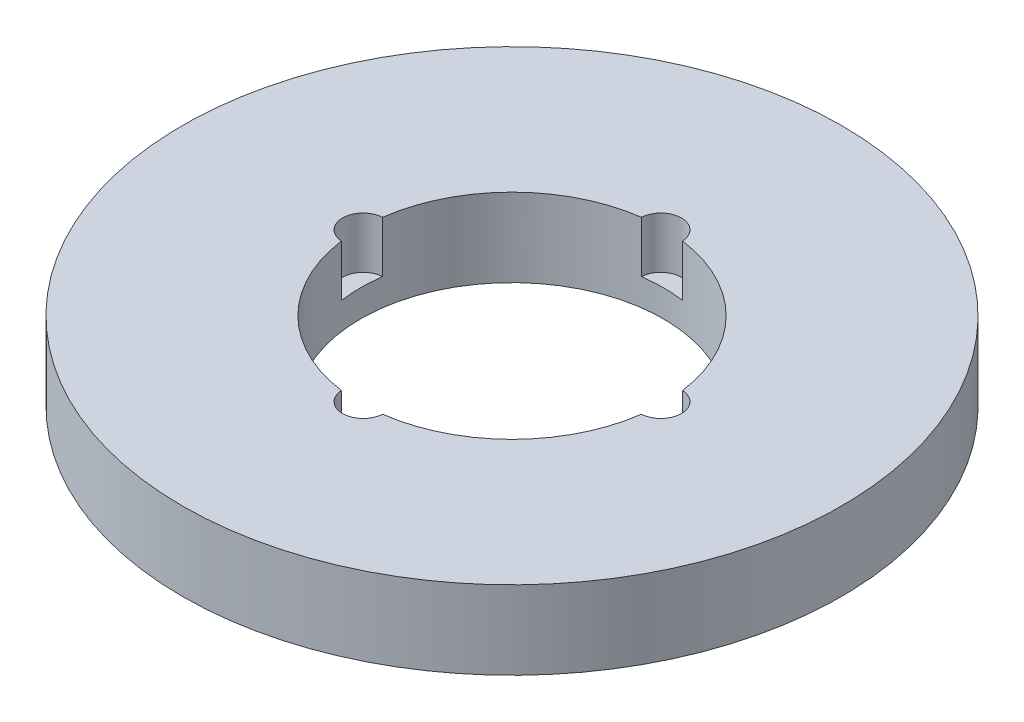
ISO-10303-21;
HEADER;
FILE_DESCRIPTION(('STEP AP214'),'2;1');
FILE_NAME('part.step','',(''),(''),'','','');
FILE_SCHEMA(('AUTOMOTIVE_DESIGN { 1 0 10303 214 1 1 1 1 }'));
ENDSEC;
DATA;
#1=APPLICATION_CONTEXT('core data for automotive mechanical design processes');
#2=APPLICATION_PROTOCOL_DEFINITION('international standard','automotive_design',2000,#1);
#3=PRODUCT_CONTEXT('',#1,'mechanical');
#4=PRODUCT('Part','Part','',(#3));
#5=PRODUCT_RELATED_PRODUCT_CATEGORY('part','',(#4));
#6=PRODUCT_DEFINITION_FORMATION('','',#4);
#7=PRODUCT_DEFINITION_CONTEXT('part definition',#1,'design');
#8=PRODUCT_DEFINITION('design','',#6,#7);
#9=PRODUCT_DEFINITION_SHAPE('','',#8);
#10=(LENGTH_UNIT() NAMED_UNIT(*) SI_UNIT(.MILLI.,.METRE.));
#11=(NAMED_UNIT(*) PLANE_ANGLE_UNIT() SI_UNIT($,.RADIAN.));
#12=(NAMED_UNIT(*) SI_UNIT($,.STERADIAN.) SOLID_ANGLE_UNIT());
#13=UNCERTAINTY_MEASURE_WITH_UNIT(LENGTH_MEASURE(1.E-05),#10,'distance_accuracy_value','');
#14=(GEOMETRIC_REPRESENTATION_CONTEXT(3) GLOBAL_UNCERTAINTY_ASSIGNED_CONTEXT((#13)) GLOBAL_UNIT_ASSIGNED_CONTEXT((#10,
#11,#12)) REPRESENTATION_CONTEXT('',''));
#15=CARTESIAN_POINT('',(0.,0.,0.));
#16=DIRECTION('',(0.,0.,1.));
#17=DIRECTION('',(1.,0.,0.));
#18=AXIS2_PLACEMENT_3D('',#15,#16,#17);
#19=CARTESIAN_POINT('',(0.,22.,0.));
#20=DIRECTION('',(0.,-1.,0.));
#21=DIRECTION('',(0.,0.,-1.));
#22=AXIS2_PLACEMENT_3D('',#19,#20,#21);
#23=CYLINDRICAL_SURFACE('',#22,92.5);
#24=CARTESIAN_POINT('',(0.,22.,0.));
#25=DIRECTION('',(0.,1.,0.));
#26=DIRECTION('',(0.,0.,1.));
#27=AXIS2_PLACEMENT_3D('',#24,#25,#26);
#28=CIRCLE('',#27,92.5);
#29=CARTESIAN_POINT('',(0.,22.,92.5));
#30=VERTEX_POINT('',#29);
#31=EDGE_CURVE('E148',#30,#30,#28,.T.);
#32=ORIENTED_EDGE('',*,*,#31,.F.);
#33=EDGE_LOOP('',(#32));
#34=FACE_BOUND('',#33,.T.);
#35=CARTESIAN_POINT('',(0.,0.,0.));
#36=DIRECTION('',(0.,1.,0.));
#37=DIRECTION('',(0.,0.,1.));
#38=AXIS2_PLACEMENT_3D('',#35,#36,#37);
#39=CIRCLE('',#38,92.5);
#40=CARTESIAN_POINT('',(0.,0.,92.5));
#41=VERTEX_POINT('',#40);
#42=EDGE_CURVE('E139',#41,#41,#39,.T.);
#43=ORIENTED_EDGE('',*,*,#42,.T.);
#44=EDGE_LOOP('',(#43));
#45=FACE_BOUND('',#44,.T.);
#46=ADVANCED_FACE('F39',(#34,#45),#23,.T.);
#47=CARTESIAN_POINT('',(0.,22.,0.));
#48=DIRECTION('',(0.,1.,0.));
#49=DIRECTION('',(0.,0.,1.));
#50=AXIS2_PLACEMENT_3D('',#47,#48,#49);
#51=PLANE('',#50);
#52=CARTESIAN_POINT('',(1.4583632236788E-13,22.,41.7691828237584));
#53=DIRECTION('',(0.,1.,0.));
#54=DIRECTION('',(1.,0.,0.));
#55=AXIS2_PLACEMENT_3D('',#52,#53,#54);
#56=CIRCLE('',#55,5.78742874804722);
#57=CARTESIAN_POINT('',(-5.77765153964873,22.,42.105447897943));
#58=VERTEX_POINT('',#57);
#59=CARTESIAN_POINT('',(5.77765153964902,22.,42.105447897943));
#60=VERTEX_POINT('',#59);
#61=EDGE_CURVE('E175',#58,#60,#56,.T.);
#62=ORIENTED_EDGE('',*,*,#61,.F.);
#63=CARTESIAN_POINT('',(0.,22.,0.));
#64=DIRECTION('',(0.,1.,0.));
#65=DIRECTION('',(0.,0.,1.));
#66=AXIS2_PLACEMENT_3D('',#63,#64,#65);
#67=CIRCLE('',#66,42.5);
#68=CARTESIAN_POINT('',(-42.105447897943,22.,5.77765153964887));
#69=VERTEX_POINT('',#68);
#70=EDGE_CURVE('E134',#69,#58,#67,.T.);
#71=ORIENTED_EDGE('',*,*,#70,.F.);
#72=CARTESIAN_POINT('',(-41.7691828237584,22.,0.));
#73=DIRECTION('',(0.,1.,0.));
#74=DIRECTION('',(0.,0.,1.));
#75=AXIS2_PLACEMENT_3D('',#72,#73,#74);
#76=CIRCLE('',#75,5.78742874804722);
#77=CARTESIAN_POINT('',(-42.105447897943,22.,-5.77765153964887));
#78=VERTEX_POINT('',#77);
#79=EDGE_CURVE('E143',#78,#69,#76,.T.);
#80=ORIENTED_EDGE('',*,*,#79,.F.);
#81=CARTESIAN_POINT('',(-5.77765153964931,22.,-42.105447897943));
#82=VERTEX_POINT('',#81);
#83=EDGE_CURVE('E123',#82,#78,#67,.T.);
#84=ORIENTED_EDGE('',*,*,#83,.F.);
#85=CARTESIAN_POINT('',(-4.37508967103639E-13,22.,-41.7691828237584));
#86=DIRECTION('',(0.,1.,0.));
#87=DIRECTION('',(-1.,0.,0.));
#88=AXIS2_PLACEMENT_3D('',#85,#86,#87);
#89=CIRCLE('',#88,5.78742874804722);
#90=CARTESIAN_POINT('',(5.77765153964843,22.,-42.1054478979431));
#91=VERTEX_POINT('',#90);
#92=EDGE_CURVE('E106',#91,#82,#89,.T.);
#93=ORIENTED_EDGE('',*,*,#92,.F.);
#94=CARTESIAN_POINT('',(42.105447897943,22.,-5.77765153964887));
#95=VERTEX_POINT('',#94);
#96=EDGE_CURVE('E125',#95,#91,#67,.T.);
#97=ORIENTED_EDGE('',*,*,#96,.F.);
#98=CARTESIAN_POINT('',(41.7691828237584,22.,0.));
#99=DIRECTION('',(0.,1.,0.));
#100=DIRECTION('',(0.,0.,-1.));
#101=AXIS2_PLACEMENT_3D('',#98,#99,#100);
#102=CIRCLE('',#101,5.78742874804722);
#103=CARTESIAN_POINT('',(42.105447897943,22.,5.77765153964887));
#104=VERTEX_POINT('',#103);
#105=EDGE_CURVE('E286',#104,#95,#102,.T.);
#106=ORIENTED_EDGE('',*,*,#105,.F.);
#107=EDGE_CURVE('E135',#60,#104,#67,.T.);
#108=ORIENTED_EDGE('',*,*,#107,.F.);
#109=EDGE_LOOP('',(#62,#71,#80,#84,#93,#97,#106,#108));
#110=FACE_BOUND('',#109,.T.);
#111=ORIENTED_EDGE('',*,*,#31,.T.);
#112=EDGE_LOOP('',(#111));
#113=FACE_BOUND('',#112,.T.);
#114=ADVANCED_FACE('F118',(#110,#113),#51,.T.);
#115=CARTESIAN_POINT('',(0.,0.,0.));
#116=DIRECTION('',(0.,1.,0.));
#117=DIRECTION('',(0.,0.,1.));
#118=AXIS2_PLACEMENT_3D('',#115,#116,#117);
#119=PLANE('',#118);
#120=CARTESIAN_POINT('',(0.,0.,0.));
#121=DIRECTION('',(0.,1.,0.));
#122=DIRECTION('',(0.,0.,1.));
#123=AXIS2_PLACEMENT_3D('',#120,#121,#122);
#124=CIRCLE('',#123,42.5);
#125=CARTESIAN_POINT('',(0.,0.,42.5));
#126=VERTEX_POINT('',#125);
#127=EDGE_CURVE('E136',#126,#126,#124,.T.);
#128=ORIENTED_EDGE('',*,*,#127,.T.);
#129=EDGE_LOOP('',(#128));
#130=FACE_BOUND('',#129,.T.);
#131=ORIENTED_EDGE('',*,*,#42,.F.);
#132=EDGE_LOOP('',(#131));
#133=FACE_BOUND('',#132,.T.);
#134=ADVANCED_FACE('F187',(#130,#133),#119,.F.);
#135=CARTESIAN_POINT('',(0.,22.,0.));
#136=DIRECTION('',(0.,-1.,0.));
#137=DIRECTION('',(0.,0.,-1.));
#138=AXIS2_PLACEMENT_3D('',#135,#136,#137);
#139=CYLINDRICAL_SURFACE('',#138,42.5);
#140=DIRECTION('',(0.,1.,0.));
#141=VECTOR('',#140,1.);
#142=CARTESIAN_POINT('',(-5.77765153964873,14.7880694732292,42.105447897943));
#143=LINE('',#142,#141);
#144=CARTESIAN_POINT('',(-5.77765153964873,7.57613894645843,42.105447897943));
#145=VERTEX_POINT('',#144);
#146=EDGE_CURVE('E11',#145,#58,#143,.T.);
#147=ORIENTED_EDGE('',*,*,#146,.F.);
#148=CARTESIAN_POINT('',(0.,7.57613894645843,0.));
#149=DIRECTION('',(0.,1.,0.));
#150=DIRECTION('',(0.,0.,1.));
#151=AXIS2_PLACEMENT_3D('',#148,#149,#150);
#152=CIRCLE('',#151,42.5);
#153=CARTESIAN_POINT('',(5.77765153964902,7.57613894645843,42.105447897943));
#154=VERTEX_POINT('',#153);
#155=EDGE_CURVE('E170',#145,#154,#152,.T.);
#156=ORIENTED_EDGE('',*,*,#155,.T.);
#157=DIRECTION('',(0.,1.,0.));
#158=VECTOR('',#157,1.);
#159=CARTESIAN_POINT('',(5.77765153964902,14.7880694732292,42.105447897943));
#160=LINE('',#159,#158);
#161=EDGE_CURVE('E46',#60,#154,#160,.F.);
#162=ORIENTED_EDGE('',*,*,#161,.F.);
#163=ORIENTED_EDGE('',*,*,#107,.T.);
#164=DIRECTION('',(0.,1.,0.));
#165=VECTOR('',#164,1.);
#166=CARTESIAN_POINT('',(42.105447897943,14.7880694732292,5.77765153964887));
#167=LINE('',#166,#165);
#168=CARTESIAN_POINT('',(42.105447897943,7.57613894645843,5.77765153964887));
#169=VERTEX_POINT('',#168);
#170=EDGE_CURVE('E164',#169,#104,#167,.T.);
#171=ORIENTED_EDGE('',*,*,#170,.F.);
#172=CARTESIAN_POINT('',(0.,7.57613894645843,0.));
#173=DIRECTION('',(0.,1.,0.));
#174=DIRECTION('',(0.,0.,1.));
#175=AXIS2_PLACEMENT_3D('',#172,#173,#174);
#176=CIRCLE('',#175,42.5);
#177=CARTESIAN_POINT('',(42.105447897943,7.57613894645843,-5.77765153964887));
#178=VERTEX_POINT('',#177);
#179=EDGE_CURVE('E115',#169,#178,#176,.T.);
#180=ORIENTED_EDGE('',*,*,#179,.T.);
#181=DIRECTION('',(0.,1.,0.));
#182=VECTOR('',#181,1.);
#183=CARTESIAN_POINT('',(42.105447897943,14.7880694732292,-5.77765153964887));
#184=LINE('',#183,#182);
#185=EDGE_CURVE('E131',#95,#178,#184,.F.);
#186=ORIENTED_EDGE('',*,*,#185,.F.);
#187=ORIENTED_EDGE('',*,*,#96,.T.);
#188=DIRECTION('',(0.,1.,0.));
#189=VECTOR('',#188,1.);
#190=CARTESIAN_POINT('',(5.77765153964843,14.7880694732292,-42.1054478979431));
#191=LINE('',#190,#189);
#192=CARTESIAN_POINT('',(5.77765153964843,7.57613894645843,-42.1054478979431));
#193=VERTEX_POINT('',#192);
#194=EDGE_CURVE('E105',#193,#91,#191,.T.);
#195=ORIENTED_EDGE('',*,*,#194,.F.);
#196=CARTESIAN_POINT('',(0.,7.57613894645843,0.));
#197=DIRECTION('',(0.,1.,0.));
#198=DIRECTION('',(0.,0.,1.));
#199=AXIS2_PLACEMENT_3D('',#196,#197,#198);
#200=CIRCLE('',#199,42.5);
#201=CARTESIAN_POINT('',(-5.77765153964931,7.57613894645843,-42.105447897943));
#202=VERTEX_POINT('',#201);
#203=EDGE_CURVE('E159',#193,#202,#200,.T.);
#204=ORIENTED_EDGE('',*,*,#203,.T.);
#205=DIRECTION('',(0.,1.,0.));
#206=VECTOR('',#205,1.);
#207=CARTESIAN_POINT('',(-5.77765153964931,14.7880694732292,-42.105447897943));
#208=LINE('',#207,#206);
#209=EDGE_CURVE('E114',#82,#202,#208,.F.);
#210=ORIENTED_EDGE('',*,*,#209,.F.);
#211=ORIENTED_EDGE('',*,*,#83,.T.);
#212=DIRECTION('',(0.,1.,0.));
#213=VECTOR('',#212,1.);
#214=CARTESIAN_POINT('',(-42.105447897943,14.7880694732292,-5.77765153964887));
#215=LINE('',#214,#213);
#216=CARTESIAN_POINT('',(-42.105447897943,7.57613894645843,-5.77765153964887));
#217=VERTEX_POINT('',#216);
#218=EDGE_CURVE('E160',#217,#78,#215,.T.);
#219=ORIENTED_EDGE('',*,*,#218,.F.);
#220=CARTESIAN_POINT('',(0.,7.57613894645843,0.));
#221=DIRECTION('',(0.,1.,0.));
#222=DIRECTION('',(0.,0.,1.));
#223=AXIS2_PLACEMENT_3D('',#220,#221,#222);
#224=CIRCLE('',#223,42.5);
#225=CARTESIAN_POINT('',(-42.105447897943,7.57613894645843,5.77765153964887));
#226=VERTEX_POINT('',#225);
#227=EDGE_CURVE('E149',#217,#226,#224,.T.);
#228=ORIENTED_EDGE('',*,*,#227,.T.);
#229=DIRECTION('',(0.,1.,0.));
#230=VECTOR('',#229,1.);
#231=CARTESIAN_POINT('',(-42.105447897943,14.7880694732292,5.77765153964887));
#232=LINE('',#231,#230);
#233=EDGE_CURVE('E152',#69,#226,#232,.F.);
#234=ORIENTED_EDGE('',*,*,#233,.F.);
#235=ORIENTED_EDGE('',*,*,#70,.T.);
#236=EDGE_LOOP('',(#147,#156,#162,#163,#171,#180,#186,#187,#195,#204,#210,#211,#219,#228,#234,#235));
#237=FACE_BOUND('',#236,.T.);
#238=ORIENTED_EDGE('',*,*,#127,.F.);
#239=EDGE_LOOP('',(#238));
#240=FACE_BOUND('',#239,.T.);
#241=ADVANCED_FACE('F126',(#237,#240),#139,.F.);
#242=CARTESIAN_POINT('',(-41.7691828237584,7.57613894645843,0.));
#243=DIRECTION('',(0.,1.,0.));
#244=DIRECTION('',(0.,0.,1.));
#245=AXIS2_PLACEMENT_3D('',#242,#243,#244);
#246=CYLINDRICAL_SURFACE('',#245,5.78742874804722);
#247=ORIENTED_EDGE('',*,*,#218,.T.);
#248=ORIENTED_EDGE('',*,*,#79,.T.);
#249=ORIENTED_EDGE('',*,*,#233,.T.);
#250=CARTESIAN_POINT('',(-41.7691828237584,7.57613894645843,0.));
#251=DIRECTION('',(0.,1.,0.));
#252=DIRECTION('',(0.,0.,1.));
#253=AXIS2_PLACEMENT_3D('',#250,#251,#252);
#254=CIRCLE('',#253,5.78742874804722);
#255=EDGE_CURVE('E144',#217,#226,#254,.T.);
#256=ORIENTED_EDGE('',*,*,#255,.F.);
#257=EDGE_LOOP('',(#247,#248,#249,#256));
#258=FACE_BOUND('',#257,.T.);
#259=ADVANCED_FACE('F200',(#258),#246,.F.);
#260=CARTESIAN_POINT('',(-41.7691828237584,7.57613894645843,0.));
#261=DIRECTION('',(0.,1.,0.));
#262=DIRECTION('',(0.,0.,1.));
#263=AXIS2_PLACEMENT_3D('',#260,#261,#262);
#264=PLANE('',#263);
#265=ORIENTED_EDGE('',*,*,#255,.T.);
#266=ORIENTED_EDGE('',*,*,#227,.F.);
#267=EDGE_LOOP('',(#265,#266));
#268=FACE_BOUND('',#267,.T.);
#269=ADVANCED_FACE('F201',(#268),#264,.T.);
#270=CARTESIAN_POINT('',(-4.37508967103639E-13,7.57613894645843,-41.7691828237584));
#271=DIRECTION('',(0.,1.,0.));
#272=DIRECTION('',(0.,0.,1.));
#273=AXIS2_PLACEMENT_3D('',#270,#271,#272);
#274=CYLINDRICAL_SURFACE('',#273,5.78742874804722);
#275=ORIENTED_EDGE('',*,*,#194,.T.);
#276=ORIENTED_EDGE('',*,*,#92,.T.);
#277=ORIENTED_EDGE('',*,*,#209,.T.);
#278=CARTESIAN_POINT('',(-4.37508967103639E-13,7.57613894645843,-41.7691828237584));
#279=DIRECTION('',(0.,1.,0.));
#280=DIRECTION('',(-1.,0.,0.));
#281=AXIS2_PLACEMENT_3D('',#278,#279,#280);
#282=CIRCLE('',#281,5.78742874804722);
#283=EDGE_CURVE('E107',#193,#202,#282,.T.);
#284=ORIENTED_EDGE('',*,*,#283,.F.);
#285=EDGE_LOOP('',(#275,#276,#277,#284));
#286=FACE_BOUND('',#285,.T.);
#287=ADVANCED_FACE('F102',(#286),#274,.F.);
#288=CARTESIAN_POINT('',(-4.37508967103639E-13,7.57613894645843,-41.7691828237584));
#289=DIRECTION('',(0.,1.,0.));
#290=DIRECTION('',(-1.,0.,0.));
#291=AXIS2_PLACEMENT_3D('',#288,#289,#290);
#292=PLANE('',#291);
#293=ORIENTED_EDGE('',*,*,#283,.T.);
#294=ORIENTED_EDGE('',*,*,#203,.F.);
#295=EDGE_LOOP('',(#293,#294));
#296=FACE_BOUND('',#295,.T.);
#297=ADVANCED_FACE('F209',(#296),#292,.T.);
#298=CARTESIAN_POINT('',(41.7691828237584,7.57613894645843,0.));
#299=DIRECTION('',(0.,1.,0.));
#300=DIRECTION('',(0.,0.,1.));
#301=AXIS2_PLACEMENT_3D('',#298,#299,#300);
#302=CYLINDRICAL_SURFACE('',#301,5.78742874804722);
#303=ORIENTED_EDGE('',*,*,#170,.T.);
#304=ORIENTED_EDGE('',*,*,#105,.T.);
#305=ORIENTED_EDGE('',*,*,#185,.T.);
#306=CARTESIAN_POINT('',(41.7691828237584,7.57613894645843,0.));
#307=DIRECTION('',(0.,1.,0.));
#308=DIRECTION('',(0.,0.,-1.));
#309=AXIS2_PLACEMENT_3D('',#306,#307,#308);
#310=CIRCLE('',#309,5.78742874804722);
#311=EDGE_CURVE('E56',#169,#178,#310,.T.);
#312=ORIENTED_EDGE('',*,*,#311,.F.);
#313=EDGE_LOOP('',(#303,#304,#305,#312));
#314=FACE_BOUND('',#313,.T.);
#315=ADVANCED_FACE('F213',(#314),#302,.F.);
#316=CARTESIAN_POINT('',(41.7691828237584,7.57613894645843,0.));
#317=DIRECTION('',(0.,1.,0.));
#318=DIRECTION('',(0.,0.,-1.));
#319=AXIS2_PLACEMENT_3D('',#316,#317,#318);
#320=PLANE('',#319);
#321=ORIENTED_EDGE('',*,*,#311,.T.);
#322=ORIENTED_EDGE('',*,*,#179,.F.);
#323=EDGE_LOOP('',(#321,#322));
#324=FACE_BOUND('',#323,.T.);
#325=ADVANCED_FACE('F179',(#324),#320,.T.);
#326=CARTESIAN_POINT('',(1.4583632236788E-13,7.57613894645843,41.7691828237584));
#327=DIRECTION('',(0.,1.,0.));
#328=DIRECTION('',(0.,0.,1.));
#329=AXIS2_PLACEMENT_3D('',#326,#327,#328);
#330=CYLINDRICAL_SURFACE('',#329,5.78742874804722);
#331=ORIENTED_EDGE('',*,*,#146,.T.);
#332=ORIENTED_EDGE('',*,*,#61,.T.);
#333=ORIENTED_EDGE('',*,*,#161,.T.);
#334=CARTESIAN_POINT('',(1.4583632236788E-13,7.57613894645843,41.7691828237584));
#335=DIRECTION('',(0.,1.,0.));
#336=DIRECTION('',(1.,0.,0.));
#337=AXIS2_PLACEMENT_3D('',#334,#335,#336);
#338=CIRCLE('',#337,5.78742874804722);
#339=EDGE_CURVE('E55',#145,#154,#338,.T.);
#340=ORIENTED_EDGE('',*,*,#339,.F.);
#341=EDGE_LOOP('',(#331,#332,#333,#340));
#342=FACE_BOUND('',#341,.T.);
#343=ADVANCED_FACE('F171',(#342),#330,.F.);
#344=CARTESIAN_POINT('',(1.4583632236788E-13,7.57613894645843,41.7691828237584));
#345=DIRECTION('',(0.,1.,0.));
#346=DIRECTION('',(1.,0.,0.));
#347=AXIS2_PLACEMENT_3D('',#344,#345,#346);
#348=PLANE('',#347);
#349=ORIENTED_EDGE('',*,*,#339,.T.);
#350=ORIENTED_EDGE('',*,*,#155,.F.);
#351=EDGE_LOOP('',(#349,#350));
#352=FACE_BOUND('',#351,.T.);
#353=ADVANCED_FACE('F173',(#352),#348,.T.);
#354=CLOSED_SHELL('',(#46,#114,#134,#241,#259,#269,#287,#297,#315,#325,#343,#353));
#355=MANIFOLD_SOLID_BREP('B2',#354);
#356=ADVANCED_BREP_SHAPE_REPRESENTATION('',(#18,#355),#14);
#357=SHAPE_DEFINITION_REPRESENTATION(#9,#356);
ENDSEC;
END-ISO-10303-21;
